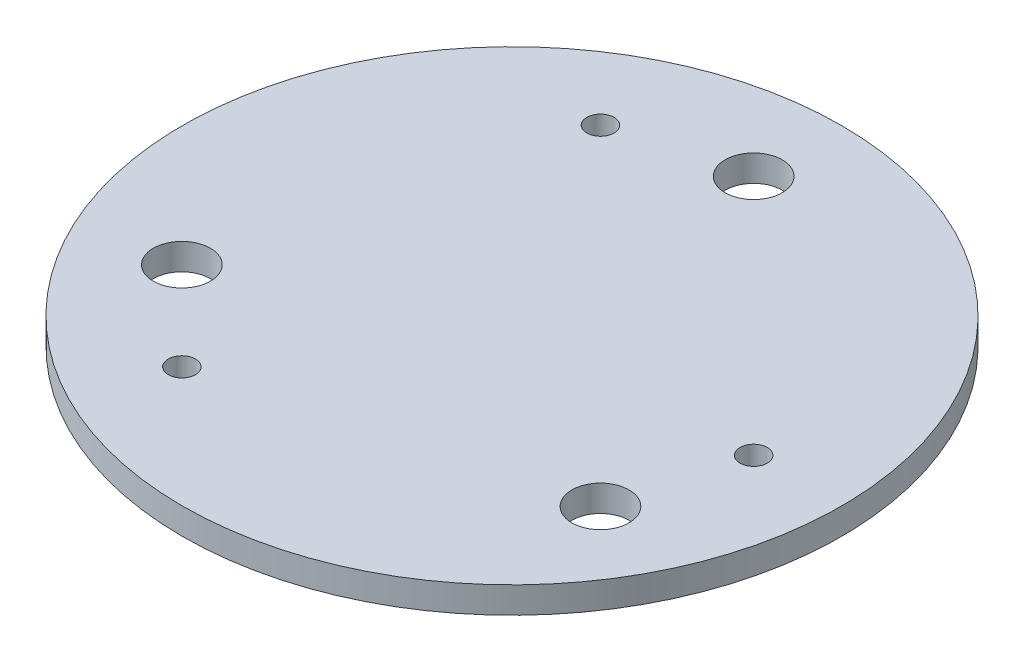
ISO-10303-21;
HEADER;
FILE_DESCRIPTION(('STEP AP214'),'2;1');
FILE_NAME('part.step','',(''),(''),'','','');
FILE_SCHEMA(('AUTOMOTIVE_DESIGN { 1 0 10303 214 1 1 1 1 }'));
ENDSEC;
DATA;
#1=APPLICATION_CONTEXT('core data for automotive mechanical design processes');
#2=APPLICATION_PROTOCOL_DEFINITION('international standard','automotive_design',2000,#1);
#3=PRODUCT_CONTEXT('',#1,'mechanical');
#4=PRODUCT('Part','Part','',(#3));
#5=PRODUCT_RELATED_PRODUCT_CATEGORY('part','',(#4));
#6=PRODUCT_DEFINITION_FORMATION('','',#4);
#7=PRODUCT_DEFINITION_CONTEXT('part definition',#1,'design');
#8=PRODUCT_DEFINITION('design','',#6,#7);
#9=PRODUCT_DEFINITION_SHAPE('','',#8);
#10=(LENGTH_UNIT() NAMED_UNIT(*) SI_UNIT(.MILLI.,.METRE.));
#11=(NAMED_UNIT(*) PLANE_ANGLE_UNIT() SI_UNIT($,.RADIAN.));
#12=(NAMED_UNIT(*) SI_UNIT($,.STERADIAN.) SOLID_ANGLE_UNIT());
#13=UNCERTAINTY_MEASURE_WITH_UNIT(LENGTH_MEASURE(1.E-05),#10,'distance_accuracy_value','');
#14=(GEOMETRIC_REPRESENTATION_CONTEXT(3) GLOBAL_UNCERTAINTY_ASSIGNED_CONTEXT((#13)) GLOBAL_UNIT_ASSIGNED_CONTEXT((#10,
#11,#12)) REPRESENTATION_CONTEXT('',''));
#15=CARTESIAN_POINT('',(0.,0.,0.));
#16=DIRECTION('',(0.,0.,1.));
#17=DIRECTION('',(1.,0.,0.));
#18=AXIS2_PLACEMENT_3D('',#15,#16,#17);
#19=CARTESIAN_POINT('',(0.,6.,-55.));
#20=DIRECTION('',(0.,-1.,0.));
#21=DIRECTION('',(0.,0.,-1.));
#22=AXIS2_PLACEMENT_3D('',#19,#20,#21);
#23=CYLINDRICAL_SURFACE('',#22,6.5);
#24=CARTESIAN_POINT('',(0.,6.,-55.));
#25=DIRECTION('',(0.,1.,0.));
#26=DIRECTION('',(0.,0.,1.));
#27=AXIS2_PLACEMENT_3D('',#24,#25,#26);
#28=CIRCLE('',#27,6.5);
#29=CARTESIAN_POINT('',(0.,6.,-48.5));
#30=VERTEX_POINT('',#29);
#31=EDGE_CURVE('E48',#30,#30,#28,.T.);
#32=ORIENTED_EDGE('',*,*,#31,.T.);
#33=EDGE_LOOP('',(#32));
#34=FACE_BOUND('',#33,.T.);
#35=CARTESIAN_POINT('',(0.,0.,-55.));
#36=DIRECTION('',(0.,1.,0.));
#37=DIRECTION('',(0.,0.,1.));
#38=AXIS2_PLACEMENT_3D('',#35,#36,#37);
#39=CIRCLE('',#38,6.5);
#40=CARTESIAN_POINT('',(0.,0.,-48.5));
#41=VERTEX_POINT('',#40);
#42=EDGE_CURVE('E77',#41,#41,#39,.T.);
#43=ORIENTED_EDGE('',*,*,#42,.F.);
#44=EDGE_LOOP('',(#43));
#45=FACE_BOUND('',#44,.T.);
#46=ADVANCED_FACE('F39',(#34,#45),#23,.F.);
#47=CARTESIAN_POINT('',(-47.6313972081449,6.,27.5000000000027));
#48=DIRECTION('',(0.,-1.,0.));
#49=DIRECTION('',(0.,0.,-1.));
#50=AXIS2_PLACEMENT_3D('',#47,#48,#49);
#51=CYLINDRICAL_SURFACE('',#50,6.5);
#52=CARTESIAN_POINT('',(-47.6313972081449,6.,27.5000000000027));
#53=DIRECTION('',(0.,1.,0.));
#54=DIRECTION('',(0.,0.,1.));
#55=AXIS2_PLACEMENT_3D('',#52,#53,#54);
#56=CIRCLE('',#55,6.5);
#57=CARTESIAN_POINT('',(-47.6313972081449,6.,34.0000000000027));
#58=VERTEX_POINT('',#57);
#59=EDGE_CURVE('E54',#58,#58,#56,.T.);
#60=ORIENTED_EDGE('',*,*,#59,.T.);
#61=EDGE_LOOP('',(#60));
#62=FACE_BOUND('',#61,.T.);
#63=CARTESIAN_POINT('',(-47.6313972081449,0.,27.5000000000027));
#64=DIRECTION('',(0.,1.,0.));
#65=DIRECTION('',(0.,0.,1.));
#66=AXIS2_PLACEMENT_3D('',#63,#64,#65);
#67=CIRCLE('',#66,6.5);
#68=CARTESIAN_POINT('',(-47.6313972081449,0.,34.0000000000027));
#69=VERTEX_POINT('',#68);
#70=EDGE_CURVE('E74',#69,#69,#67,.T.);
#71=ORIENTED_EDGE('',*,*,#70,.F.);
#72=EDGE_LOOP('',(#71));
#73=FACE_BOUND('',#72,.T.);
#74=ADVANCED_FACE('F108',(#62,#73),#51,.F.);
#75=CARTESIAN_POINT('',(47.6313972081461,6.,27.500000000002));
#76=DIRECTION('',(0.,-1.,0.));
#77=DIRECTION('',(0.,0.,-1.));
#78=AXIS2_PLACEMENT_3D('',#75,#76,#77);
#79=CYLINDRICAL_SURFACE('',#78,6.5);
#80=CARTESIAN_POINT('',(47.6313972081461,6.,27.500000000002));
#81=DIRECTION('',(0.,1.,0.));
#82=DIRECTION('',(0.,0.,1.));
#83=AXIS2_PLACEMENT_3D('',#80,#81,#82);
#84=CIRCLE('',#83,6.5);
#85=CARTESIAN_POINT('',(47.6313972081461,6.,34.000000000002));
#86=VERTEX_POINT('',#85);
#87=EDGE_CURVE('E101',#86,#86,#84,.T.);
#88=ORIENTED_EDGE('',*,*,#87,.T.);
#89=EDGE_LOOP('',(#88));
#90=FACE_BOUND('',#89,.T.);
#91=CARTESIAN_POINT('',(47.6313972081461,0.,27.500000000002));
#92=DIRECTION('',(0.,1.,0.));
#93=DIRECTION('',(0.,0.,1.));
#94=AXIS2_PLACEMENT_3D('',#91,#92,#93);
#95=CIRCLE('',#94,6.5);
#96=CARTESIAN_POINT('',(47.6313972081461,0.,34.000000000002));
#97=VERTEX_POINT('',#96);
#98=EDGE_CURVE('E70',#97,#97,#95,.T.);
#99=ORIENTED_EDGE('',*,*,#98,.F.);
#100=EDGE_LOOP('',(#99));
#101=FACE_BOUND('',#100,.T.);
#102=ADVANCED_FACE('F126',(#90,#101),#79,.F.);
#103=CARTESIAN_POINT('',(-27.5000000000002,6.,-47.631397208144));
#104=DIRECTION('',(0.,-1.,0.));
#105=DIRECTION('',(0.,0.,-1.));
#106=AXIS2_PLACEMENT_3D('',#103,#104,#105);
#107=CYLINDRICAL_SURFACE('',#106,3.1);
#108=CARTESIAN_POINT('',(-27.5000000000002,6.,-47.631397208144));
#109=DIRECTION('',(0.,1.,0.));
#110=DIRECTION('',(0.,0.,1.));
#111=AXIS2_PLACEMENT_3D('',#108,#109,#110);
#112=CIRCLE('',#111,3.1);
#113=CARTESIAN_POINT('',(-27.5000000000002,6.,-44.531397208144));
#114=VERTEX_POINT('',#113);
#115=EDGE_CURVE('E95',#114,#114,#112,.T.);
#116=ORIENTED_EDGE('',*,*,#115,.T.);
#117=EDGE_LOOP('',(#116));
#118=FACE_BOUND('',#117,.T.);
#119=CARTESIAN_POINT('',(-27.5000000000002,0.,-47.631397208144));
#120=DIRECTION('',(0.,1.,0.));
#121=DIRECTION('',(0.,0.,1.));
#122=AXIS2_PLACEMENT_3D('',#119,#120,#121);
#123=CIRCLE('',#122,3.1);
#124=CARTESIAN_POINT('',(-27.5000000000002,0.,-44.531397208144));
#125=VERTEX_POINT('',#124);
#126=EDGE_CURVE('E66',#125,#125,#123,.T.);
#127=ORIENTED_EDGE('',*,*,#126,.F.);
#128=EDGE_LOOP('',(#127));
#129=FACE_BOUND('',#128,.T.);
#130=ADVANCED_FACE('F133',(#118,#129),#107,.F.);
#131=CARTESIAN_POINT('',(55.,6.,0.));
#132=DIRECTION('',(0.,-1.,0.));
#133=DIRECTION('',(0.,0.,-1.));
#134=AXIS2_PLACEMENT_3D('',#131,#132,#133);
#135=CYLINDRICAL_SURFACE('',#134,3.1);
#136=CARTESIAN_POINT('',(55.,6.,0.));
#137=DIRECTION('',(0.,1.,0.));
#138=DIRECTION('',(0.,0.,1.));
#139=AXIS2_PLACEMENT_3D('',#136,#137,#138);
#140=CIRCLE('',#139,3.1);
#141=CARTESIAN_POINT('',(55.,6.,3.1));
#142=VERTEX_POINT('',#141);
#143=EDGE_CURVE('E89',#142,#142,#140,.T.);
#144=ORIENTED_EDGE('',*,*,#143,.T.);
#145=EDGE_LOOP('',(#144));
#146=FACE_BOUND('',#145,.T.);
#147=CARTESIAN_POINT('',(55.,0.,0.));
#148=DIRECTION('',(0.,1.,0.));
#149=DIRECTION('',(0.,0.,1.));
#150=AXIS2_PLACEMENT_3D('',#147,#148,#149);
#151=CIRCLE('',#150,3.1);
#152=CARTESIAN_POINT('',(55.,0.,3.1));
#153=VERTEX_POINT('',#152);
#154=EDGE_CURVE('E62',#153,#153,#151,.T.);
#155=ORIENTED_EDGE('',*,*,#154,.F.);
#156=EDGE_LOOP('',(#155));
#157=FACE_BOUND('',#156,.T.);
#158=ADVANCED_FACE('F136',(#146,#157),#135,.F.);
#159=CARTESIAN_POINT('',(-27.4999999999996,6.,47.6313972081444));
#160=DIRECTION('',(0.,-1.,0.));
#161=DIRECTION('',(0.,0.,-1.));
#162=AXIS2_PLACEMENT_3D('',#159,#160,#161);
#163=CYLINDRICAL_SURFACE('',#162,3.1);
#164=CARTESIAN_POINT('',(-27.4999999999996,6.,47.6313972081444));
#165=DIRECTION('',(0.,1.,0.));
#166=DIRECTION('',(0.,0.,1.));
#167=AXIS2_PLACEMENT_3D('',#164,#165,#166);
#168=CIRCLE('',#167,3.1);
#169=CARTESIAN_POINT('',(-27.4999999999996,6.,50.7313972081444));
#170=VERTEX_POINT('',#169);
#171=EDGE_CURVE('E84',#170,#170,#168,.T.);
#172=ORIENTED_EDGE('',*,*,#171,.T.);
#173=EDGE_LOOP('',(#172));
#174=FACE_BOUND('',#173,.T.);
#175=CARTESIAN_POINT('',(-27.4999999999996,0.,47.6313972081444));
#176=DIRECTION('',(0.,1.,0.));
#177=DIRECTION('',(0.,0.,1.));
#178=AXIS2_PLACEMENT_3D('',#175,#176,#177);
#179=CIRCLE('',#178,3.1);
#180=CARTESIAN_POINT('',(-27.4999999999996,0.,50.7313972081444));
#181=VERTEX_POINT('',#180);
#182=EDGE_CURVE('E58',#181,#181,#179,.T.);
#183=ORIENTED_EDGE('',*,*,#182,.F.);
#184=EDGE_LOOP('',(#183));
#185=FACE_BOUND('',#184,.T.);
#186=ADVANCED_FACE('F41',(#174,#185),#163,.F.);
#187=CARTESIAN_POINT('',(0.,6.,0.));
#188=DIRECTION('',(0.,-1.,0.));
#189=DIRECTION('',(0.,0.,-1.));
#190=AXIS2_PLACEMENT_3D('',#187,#188,#189);
#191=CYLINDRICAL_SURFACE('',#190,75.);
#192=CARTESIAN_POINT('',(0.,6.,0.));
#193=DIRECTION('',(0.,1.,0.));
#194=DIRECTION('',(0.,0.,1.));
#195=AXIS2_PLACEMENT_3D('',#192,#193,#194);
#196=CIRCLE('',#195,75.);
#197=CARTESIAN_POINT('',(0.,6.,75.));
#198=VERTEX_POINT('',#197);
#199=EDGE_CURVE('E10',#198,#198,#196,.T.);
#200=ORIENTED_EDGE('',*,*,#199,.F.);
#201=EDGE_LOOP('',(#200));
#202=FACE_BOUND('',#201,.T.);
#203=CARTESIAN_POINT('',(0.,0.,0.));
#204=DIRECTION('',(0.,1.,0.));
#205=DIRECTION('',(0.,0.,1.));
#206=AXIS2_PLACEMENT_3D('',#203,#204,#205);
#207=CIRCLE('',#206,75.);
#208=CARTESIAN_POINT('',(0.,0.,75.));
#209=VERTEX_POINT('',#208);
#210=EDGE_CURVE('E43',#209,#209,#207,.T.);
#211=ORIENTED_EDGE('',*,*,#210,.T.);
#212=EDGE_LOOP('',(#211));
#213=FACE_BOUND('',#212,.T.);
#214=ADVANCED_FACE('F115',(#202,#213),#191,.T.);
#215=CARTESIAN_POINT('',(0.,6.,0.));
#216=DIRECTION('',(0.,1.,0.));
#217=DIRECTION('',(0.,0.,1.));
#218=AXIS2_PLACEMENT_3D('',#215,#216,#217);
#219=PLANE('',#218);
#220=ORIENTED_EDGE('',*,*,#171,.F.);
#221=EDGE_LOOP('',(#220));
#222=FACE_BOUND('',#221,.T.);
#223=ORIENTED_EDGE('',*,*,#143,.F.);
#224=EDGE_LOOP('',(#223));
#225=FACE_BOUND('',#224,.T.);
#226=ORIENTED_EDGE('',*,*,#115,.F.);
#227=EDGE_LOOP('',(#226));
#228=FACE_BOUND('',#227,.T.);
#229=ORIENTED_EDGE('',*,*,#87,.F.);
#230=EDGE_LOOP('',(#229));
#231=FACE_BOUND('',#230,.T.);
#232=ORIENTED_EDGE('',*,*,#59,.F.);
#233=EDGE_LOOP('',(#232));
#234=FACE_BOUND('',#233,.T.);
#235=ORIENTED_EDGE('',*,*,#31,.F.);
#236=EDGE_LOOP('',(#235));
#237=FACE_BOUND('',#236,.T.);
#238=ORIENTED_EDGE('',*,*,#199,.T.);
#239=EDGE_LOOP('',(#238));
#240=FACE_BOUND('',#239,.T.);
#241=ADVANCED_FACE('F111',(#222,#225,#228,#231,#234,#237,#240),#219,.T.);
#242=CARTESIAN_POINT('',(0.,0.,0.));
#243=DIRECTION('',(0.,1.,0.));
#244=DIRECTION('',(0.,0.,1.));
#245=AXIS2_PLACEMENT_3D('',#242,#243,#244);
#246=PLANE('',#245);
#247=ORIENTED_EDGE('',*,*,#182,.T.);
#248=EDGE_LOOP('',(#247));
#249=FACE_BOUND('',#248,.T.);
#250=ORIENTED_EDGE('',*,*,#154,.T.);
#251=EDGE_LOOP('',(#250));
#252=FACE_BOUND('',#251,.T.);
#253=ORIENTED_EDGE('',*,*,#126,.T.);
#254=EDGE_LOOP('',(#253));
#255=FACE_BOUND('',#254,.T.);
#256=ORIENTED_EDGE('',*,*,#98,.T.);
#257=EDGE_LOOP('',(#256));
#258=FACE_BOUND('',#257,.T.);
#259=ORIENTED_EDGE('',*,*,#70,.T.);
#260=EDGE_LOOP('',(#259));
#261=FACE_BOUND('',#260,.T.);
#262=ORIENTED_EDGE('',*,*,#42,.T.);
#263=EDGE_LOOP('',(#262));
#264=FACE_BOUND('',#263,.T.);
#265=ORIENTED_EDGE('',*,*,#210,.F.);
#266=EDGE_LOOP('',(#265));
#267=FACE_BOUND('',#266,.T.);
#268=ADVANCED_FACE('F114',(#249,#252,#255,#258,#261,#264,#267),#246,.F.);
#269=CLOSED_SHELL('',(#46,#74,#102,#130,#158,#186,#214,#241,#268));
#270=MANIFOLD_SOLID_BREP('B2',#269);
#271=ADVANCED_BREP_SHAPE_REPRESENTATION('',(#18,#270),#14);
#272=SHAPE_DEFINITION_REPRESENTATION(#9,#271);
ENDSEC;
END-ISO-10303-21;
